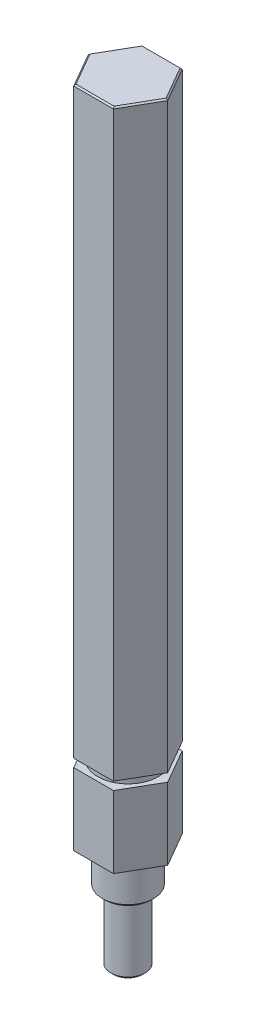
ISO-10303-21;
HEADER;
FILE_DESCRIPTION(('STEP AP214'),'2;1');
FILE_NAME('part.step','',(''),(''),'','','');
FILE_SCHEMA(('AUTOMOTIVE_DESIGN { 1 0 10303 214 1 1 1 1 }'));
ENDSEC;
DATA;
#1=APPLICATION_CONTEXT('core data for automotive mechanical design processes');
#2=APPLICATION_PROTOCOL_DEFINITION('international standard','automotive_design',2000,#1);
#3=PRODUCT_CONTEXT('',#1,'mechanical');
#4=PRODUCT('Part','Part','',(#3));
#5=PRODUCT_RELATED_PRODUCT_CATEGORY('part','',(#4));
#6=PRODUCT_DEFINITION_FORMATION('','',#4);
#7=PRODUCT_DEFINITION_CONTEXT('part definition',#1,'design');
#8=PRODUCT_DEFINITION('design','',#6,#7);
#9=PRODUCT_DEFINITION_SHAPE('','',#8);
#10=(LENGTH_UNIT() NAMED_UNIT(*) SI_UNIT(.MILLI.,.METRE.));
#11=(NAMED_UNIT(*) PLANE_ANGLE_UNIT() SI_UNIT($,.RADIAN.));
#12=(NAMED_UNIT(*) SI_UNIT($,.STERADIAN.) SOLID_ANGLE_UNIT());
#13=UNCERTAINTY_MEASURE_WITH_UNIT(LENGTH_MEASURE(1.E-05),#10,'distance_accuracy_value','');
#14=(GEOMETRIC_REPRESENTATION_CONTEXT(3) GLOBAL_UNCERTAINTY_ASSIGNED_CONTEXT((#13)) GLOBAL_UNIT_ASSIGNED_CONTEXT((#10,
#11,#12)) REPRESENTATION_CONTEXT('',''));
#15=CARTESIAN_POINT('',(0.,0.,0.));
#16=DIRECTION('',(0.,0.,1.));
#17=DIRECTION('',(1.,0.,0.));
#18=AXIS2_PLACEMENT_3D('',#15,#16,#17);
#19=CARTESIAN_POINT('',(-45.6394821348514,-25.4,-16.669011646302));
#20=DIRECTION('',(-0.866025403784438,0.,0.5));
#21=DIRECTION('',(0.5,0.,0.866025403784439));
#22=AXIS2_PLACEMENT_3D('',#19,#20,#21);
#23=PLANE('',#22);
#24=DIRECTION('',(0.5,0.,0.866025403784439));
#25=VECTOR('',#24,1.);
#26=CARTESIAN_POINT('',(-45.6394821348514,-12.1158,-16.669011646302));
#27=LINE('',#26,#25);
#28=CARTESIAN_POINT('',(-45.6394821348514,-12.1158,-16.669011646302));
#29=VERTEX_POINT('',#28);
#30=CARTESIAN_POINT('',(-41.9733079254973,-12.1158,-10.319011646302));
#31=VERTEX_POINT('',#30);
#32=EDGE_CURVE('E262',#29,#31,#27,.T.);
#33=ORIENTED_EDGE('',*,*,#32,.F.);
#34=DIRECTION('',(0.,1.,0.));
#35=VECTOR('',#34,1.);
#36=CARTESIAN_POINT('',(-45.6394821348514,-25.4,-16.669011646302));
#37=LINE('',#36,#35);
#38=CARTESIAN_POINT('',(-45.6394821348514,-25.4,-16.669011646302));
#39=VERTEX_POINT('',#38);
#40=EDGE_CURVE('E298',#39,#29,#37,.T.);
#41=ORIENTED_EDGE('',*,*,#40,.F.);
#42=DIRECTION('',(0.5,0.,0.866025403784439));
#43=VECTOR('',#42,1.);
#44=CARTESIAN_POINT('',(-45.6394821348514,-25.4,-16.669011646302));
#45=LINE('',#44,#43);
#46=CARTESIAN_POINT('',(-41.9733079254973,-25.4,-10.319011646302));
#47=VERTEX_POINT('',#46);
#48=EDGE_CURVE('E282',#39,#47,#45,.T.);
#49=ORIENTED_EDGE('',*,*,#48,.T.);
#50=DIRECTION('',(0.,1.,0.));
#51=VECTOR('',#50,1.);
#52=CARTESIAN_POINT('',(-41.9733079254973,-25.4,-10.319011646302));
#53=LINE('',#52,#51);
#54=EDGE_CURVE('E191',#47,#31,#53,.T.);
#55=ORIENTED_EDGE('',*,*,#54,.T.);
#56=EDGE_LOOP('',(#33,#41,#49,#55));
#57=FACE_BOUND('',#56,.T.);
#58=ADVANCED_FACE('F48',(#57),#23,.T.);
#59=CARTESIAN_POINT('',(-41.9733079254973,-25.4,-10.319011646302));
#60=DIRECTION('',(0.,0.,1.));
#61=DIRECTION('',(1.,0.,0.));
#62=AXIS2_PLACEMENT_3D('',#59,#60,#61);
#63=PLANE('',#62);
#64=DIRECTION('',(1.,0.,0.));
#65=VECTOR('',#64,1.);
#66=CARTESIAN_POINT('',(-41.9733079254973,-12.1158,-10.319011646302));
#67=LINE('',#66,#65);
#68=CARTESIAN_POINT('',(-34.640959506789,-12.1158,-10.319011646302));
#69=VERTEX_POINT('',#68);
#70=EDGE_CURVE('E163',#31,#69,#67,.T.);
#71=ORIENTED_EDGE('',*,*,#70,.F.);
#72=ORIENTED_EDGE('',*,*,#54,.F.);
#73=DIRECTION('',(1.,0.,0.));
#74=VECTOR('',#73,1.);
#75=CARTESIAN_POINT('',(-41.9733079254973,-25.4,-10.319011646302));
#76=LINE('',#75,#74);
#77=CARTESIAN_POINT('',(-34.640959506789,-25.4,-10.319011646302));
#78=VERTEX_POINT('',#77);
#79=EDGE_CURVE('E283',#47,#78,#76,.T.);
#80=ORIENTED_EDGE('',*,*,#79,.T.);
#81=DIRECTION('',(0.,1.,0.));
#82=VECTOR('',#81,1.);
#83=CARTESIAN_POINT('',(-34.640959506789,-25.4,-10.319011646302));
#84=LINE('',#83,#82);
#85=EDGE_CURVE('E185',#78,#69,#84,.T.);
#86=ORIENTED_EDGE('',*,*,#85,.T.);
#87=EDGE_LOOP('',(#71,#72,#80,#86));
#88=FACE_BOUND('',#87,.T.);
#89=ADVANCED_FACE('F356',(#88),#63,.T.);
#90=CARTESIAN_POINT('',(-34.640959506789,-25.4,-10.319011646302));
#91=DIRECTION('',(0.866025403784438,0.,0.500000000000001));
#92=DIRECTION('',(0.500000000000001,0.,-0.866025403784438));
#93=AXIS2_PLACEMENT_3D('',#90,#91,#92);
#94=PLANE('',#93);
#95=DIRECTION('',(0.500000000000001,0.,-0.866025403784438));
#96=VECTOR('',#95,1.);
#97=CARTESIAN_POINT('',(-34.640959506789,-12.1158,-10.319011646302));
#98=LINE('',#97,#96);
#99=CARTESIAN_POINT('',(-30.9747852974349,-12.1158,-16.669011646302));
#100=VERTEX_POINT('',#99);
#101=EDGE_CURVE('E157',#69,#100,#98,.T.);
#102=ORIENTED_EDGE('',*,*,#101,.F.);
#103=ORIENTED_EDGE('',*,*,#85,.F.);
#104=DIRECTION('',(0.500000000000001,0.,-0.866025403784438));
#105=VECTOR('',#104,1.);
#106=CARTESIAN_POINT('',(-34.640959506789,-25.4,-10.319011646302));
#107=LINE('',#106,#105);
#108=CARTESIAN_POINT('',(-30.9747852974349,-25.4,-16.669011646302));
#109=VERTEX_POINT('',#108);
#110=EDGE_CURVE('E179',#78,#109,#107,.T.);
#111=ORIENTED_EDGE('',*,*,#110,.T.);
#112=DIRECTION('',(0.,1.,0.));
#113=VECTOR('',#112,1.);
#114=CARTESIAN_POINT('',(-30.9747852974349,-25.4,-16.669011646302));
#115=LINE('',#114,#113);
#116=EDGE_CURVE('E172',#109,#100,#115,.T.);
#117=ORIENTED_EDGE('',*,*,#116,.T.);
#118=EDGE_LOOP('',(#102,#103,#111,#117));
#119=FACE_BOUND('',#118,.T.);
#120=ADVANCED_FACE('F177',(#119),#94,.T.);
#121=CARTESIAN_POINT('',(-30.9747852974349,-25.4,-16.669011646302));
#122=DIRECTION('',(0.866025403784438,0.,-0.5));
#123=DIRECTION('',(-0.5,0.,-0.866025403784439));
#124=AXIS2_PLACEMENT_3D('',#121,#122,#123);
#125=PLANE('',#124);
#126=DIRECTION('',(-0.5,0.,-0.866025403784439));
#127=VECTOR('',#126,1.);
#128=CARTESIAN_POINT('',(-30.9747852974349,-12.1158,-16.669011646302));
#129=LINE('',#128,#127);
#130=CARTESIAN_POINT('',(-34.640959506789,-12.1158,-23.019011646302));
#131=VERTEX_POINT('',#130);
#132=EDGE_CURVE('E160',#100,#131,#129,.T.);
#133=ORIENTED_EDGE('',*,*,#132,.F.);
#134=ORIENTED_EDGE('',*,*,#116,.F.);
#135=DIRECTION('',(-0.5,0.,-0.866025403784439));
#136=VECTOR('',#135,1.);
#137=CARTESIAN_POINT('',(-30.9747852974349,-25.4,-16.669011646302));
#138=LINE('',#137,#136);
#139=CARTESIAN_POINT('',(-34.640959506789,-25.4,-23.019011646302));
#140=VERTEX_POINT('',#139);
#141=EDGE_CURVE('E287',#109,#140,#138,.T.);
#142=ORIENTED_EDGE('',*,*,#141,.T.);
#143=DIRECTION('',(0.,1.,0.));
#144=VECTOR('',#143,1.);
#145=CARTESIAN_POINT('',(-34.640959506789,-25.4,-23.019011646302));
#146=LINE('',#145,#144);
#147=EDGE_CURVE('E174',#140,#131,#146,.T.);
#148=ORIENTED_EDGE('',*,*,#147,.T.);
#149=EDGE_LOOP('',(#133,#134,#142,#148));
#150=FACE_BOUND('',#149,.T.);
#151=ADVANCED_FACE('F170',(#150),#125,.T.);
#152=CARTESIAN_POINT('',(-34.640959506789,-25.4,-23.019011646302));
#153=DIRECTION('',(0.,0.,-1.));
#154=DIRECTION('',(-1.,0.,0.));
#155=AXIS2_PLACEMENT_3D('',#152,#153,#154);
#156=PLANE('',#155);
#157=DIRECTION('',(-1.,0.,0.));
#158=VECTOR('',#157,1.);
#159=CARTESIAN_POINT('',(-34.640959506789,-12.1158,-23.019011646302));
#160=LINE('',#159,#158);
#161=CARTESIAN_POINT('',(-41.9733079254973,-12.1158,-23.019011646302));
#162=VERTEX_POINT('',#161);
#163=EDGE_CURVE('E175',#131,#162,#160,.T.);
#164=ORIENTED_EDGE('',*,*,#163,.F.);
#165=ORIENTED_EDGE('',*,*,#147,.F.);
#166=DIRECTION('',(-1.,0.,0.));
#167=VECTOR('',#166,1.);
#168=CARTESIAN_POINT('',(-34.640959506789,-25.4,-23.019011646302));
#169=LINE('',#168,#167);
#170=CARTESIAN_POINT('',(-41.9733079254973,-25.4,-23.019011646302));
#171=VERTEX_POINT('',#170);
#172=EDGE_CURVE('E289',#140,#171,#169,.T.);
#173=ORIENTED_EDGE('',*,*,#172,.T.);
#174=DIRECTION('',(0.,1.,0.));
#175=VECTOR('',#174,1.);
#176=CARTESIAN_POINT('',(-41.9733079254973,-25.4,-23.019011646302));
#177=LINE('',#176,#175);
#178=EDGE_CURVE('E301',#171,#162,#177,.T.);
#179=ORIENTED_EDGE('',*,*,#178,.T.);
#180=EDGE_LOOP('',(#164,#165,#173,#179));
#181=FACE_BOUND('',#180,.T.);
#182=ADVANCED_FACE('F461',(#181),#156,.T.);
#183=CARTESIAN_POINT('',(-41.9733079254973,-25.4,-23.019011646302));
#184=DIRECTION('',(-0.866025403784438,0.,-0.5));
#185=DIRECTION('',(-0.5,0.,0.866025403784439));
#186=AXIS2_PLACEMENT_3D('',#183,#184,#185);
#187=PLANE('',#186);
#188=DIRECTION('',(-0.5,0.,0.866025403784439));
#189=VECTOR('',#188,1.);
#190=CARTESIAN_POINT('',(-41.9733079254973,-12.1158,-23.019011646302));
#191=LINE('',#190,#189);
#192=EDGE_CURVE('E206',#162,#29,#191,.T.);
#193=ORIENTED_EDGE('',*,*,#192,.F.);
#194=ORIENTED_EDGE('',*,*,#178,.F.);
#195=DIRECTION('',(-0.5,0.,0.866025403784439));
#196=VECTOR('',#195,1.);
#197=CARTESIAN_POINT('',(-41.9733079254973,-25.4,-23.019011646302));
#198=LINE('',#197,#196);
#199=EDGE_CURVE('E292',#171,#39,#198,.T.);
#200=ORIENTED_EDGE('',*,*,#199,.T.);
#201=ORIENTED_EDGE('',*,*,#40,.T.);
#202=EDGE_LOOP('',(#193,#194,#200,#201));
#203=FACE_BOUND('',#202,.T.);
#204=ADVANCED_FACE('F471',(#203),#187,.T.);
#205=CARTESIAN_POINT('',(-38.3071337161431,-25.4,-3.96901164630201));
#206=DIRECTION('',(0.,1.,0.));
#207=DIRECTION('',(0.,0.,1.));
#208=AXIS2_PLACEMENT_3D('',#205,#206,#207);
#209=PLANE('',#208);
#210=CARTESIAN_POINT('',(-38.3071337161431,-25.4,-16.669011646302));
#211=DIRECTION('',(0.,1.,0.));
#212=DIRECTION('',(1.,0.,0.));
#213=AXIS2_PLACEMENT_3D('',#210,#211,#212);
#214=CIRCLE('',#213,4.7498);
#215=CARTESIAN_POINT('',(-33.5573337161431,-25.4,-16.669011646302));
#216=VERTEX_POINT('',#215);
#217=EDGE_CURVE('E278',#216,#216,#214,.T.);
#218=ORIENTED_EDGE('',*,*,#217,.T.);
#219=EDGE_LOOP('',(#218));
#220=FACE_BOUND('',#219,.T.);
#221=ORIENTED_EDGE('',*,*,#48,.F.);
#222=ORIENTED_EDGE('',*,*,#199,.F.);
#223=ORIENTED_EDGE('',*,*,#172,.F.);
#224=ORIENTED_EDGE('',*,*,#141,.F.);
#225=ORIENTED_EDGE('',*,*,#110,.F.);
#226=ORIENTED_EDGE('',*,*,#79,.F.);
#227=EDGE_LOOP('',(#221,#222,#223,#224,#225,#226));
#228=FACE_BOUND('',#227,.T.);
#229=ADVANCED_FACE('F577',(#220,#228),#209,.F.);
#230=CARTESIAN_POINT('',(-38.3071337161431,-32.512,-16.669011646302));
#231=DIRECTION('',(0.,1.,0.));
#232=DIRECTION('',(0.,0.,1.));
#233=AXIS2_PLACEMENT_3D('',#230,#231,#232);
#234=CYLINDRICAL_SURFACE('',#233,4.7498);
#235=CARTESIAN_POINT('',(-38.3071337161431,-32.004,-16.669011646302));
#236=DIRECTION('',(0.,1.,0.));
#237=DIRECTION('',(0.,0.,1.));
#238=AXIS2_PLACEMENT_3D('',#235,#236,#237);
#239=CIRCLE('',#238,4.7498);
#240=CARTESIAN_POINT('',(-38.3071337161431,-32.004,-11.919211646302));
#241=VERTEX_POINT('',#240);
#242=EDGE_CURVE('E194',#241,#241,#239,.T.);
#243=ORIENTED_EDGE('',*,*,#242,.T.);
#244=EDGE_LOOP('',(#243));
#245=FACE_BOUND('',#244,.T.);
#246=ORIENTED_EDGE('',*,*,#217,.F.);
#247=EDGE_LOOP('',(#246));
#248=FACE_BOUND('',#247,.T.);
#249=ADVANCED_FACE('F566',(#245,#248),#234,.T.);
#250=CARTESIAN_POINT('',(-38.3071337161431,-32.512,-16.669011646302));
#251=DIRECTION('',(0.,1.,0.));
#252=DIRECTION('',(0.,0.,1.));
#253=AXIS2_PLACEMENT_3D('',#250,#251,#252);
#254=PLANE('',#253);
#255=CARTESIAN_POINT('',(-38.3071337161431,-32.512,-16.669011646302));
#256=DIRECTION('',(0.,1.,0.));
#257=DIRECTION('',(0.,0.,1.));
#258=AXIS2_PLACEMENT_3D('',#255,#256,#257);
#259=CIRCLE('',#258,3.1623);
#260=CARTESIAN_POINT('',(-38.3071337161431,-32.512,-13.506711646302));
#261=VERTEX_POINT('',#260);
#262=EDGE_CURVE('E274',#261,#261,#259,.T.);
#263=ORIENTED_EDGE('',*,*,#262,.T.);
#264=EDGE_LOOP('',(#263));
#265=FACE_BOUND('',#264,.T.);
#266=CARTESIAN_POINT('',(-38.3071337161431,-32.512,-16.669011646302));
#267=DIRECTION('',(0.,1.,0.));
#268=DIRECTION('',(0.,0.,1.));
#269=AXIS2_PLACEMENT_3D('',#266,#267,#268);
#270=CIRCLE('',#269,4.2418);
#271=CARTESIAN_POINT('',(-38.3071337161431,-32.512,-12.427211646302));
#272=VERTEX_POINT('',#271);
#273=EDGE_CURVE('E197',#272,#272,#270,.F.);
#274=ORIENTED_EDGE('',*,*,#273,.T.);
#275=EDGE_LOOP('',(#274));
#276=FACE_BOUND('',#275,.T.);
#277=ADVANCED_FACE('F554',(#265,#276),#254,.F.);
#278=CARTESIAN_POINT('',(-38.3071337161431,-32.004,-16.669011646302));
#279=DIRECTION('',(0.,1.,0.));
#280=DIRECTION('',(0.,0.,1.));
#281=AXIS2_PLACEMENT_3D('',#278,#279,#280);
#282=CONICAL_SURFACE('',#281,4.7498,0.785398163397443);
#283=ORIENTED_EDGE('',*,*,#273,.F.);
#284=EDGE_LOOP('',(#283));
#285=FACE_BOUND('',#284,.T.);
#286=ORIENTED_EDGE('',*,*,#242,.F.);
#287=EDGE_LOOP('',(#286));
#288=FACE_BOUND('',#287,.T.);
#289=ADVANCED_FACE('F541',(#285,#288),#282,.T.);
#290=CARTESIAN_POINT('',(-38.3071337161431,-45.212,-16.669011646302));
#291=DIRECTION('',(0.,1.,0.));
#292=DIRECTION('',(0.,0.,1.));
#293=AXIS2_PLACEMENT_3D('',#290,#291,#292);
#294=CYLINDRICAL_SURFACE('',#293,3.1623);
#295=CARTESIAN_POINT('',(-38.3071337161431,-44.704,-16.669011646302));
#296=DIRECTION('',(0.,1.,0.));
#297=DIRECTION('',(0.,0.,1.));
#298=AXIS2_PLACEMENT_3D('',#295,#296,#297);
#299=CIRCLE('',#298,3.1623);
#300=CARTESIAN_POINT('',(-38.3071337161431,-44.704,-13.506711646302));
#301=VERTEX_POINT('',#300);
#302=EDGE_CURVE('E200',#301,#301,#299,.T.);
#303=ORIENTED_EDGE('',*,*,#302,.T.);
#304=EDGE_LOOP('',(#303));
#305=FACE_BOUND('',#304,.T.);
#306=ORIENTED_EDGE('',*,*,#262,.F.);
#307=EDGE_LOOP('',(#306));
#308=FACE_BOUND('',#307,.T.);
#309=ADVANCED_FACE('F529',(#305,#308),#294,.T.);
#310=CARTESIAN_POINT('',(-38.3071337161431,-45.212,-16.669011646302));
#311=DIRECTION('',(0.,1.,0.));
#312=DIRECTION('',(0.,0.,1.));
#313=AXIS2_PLACEMENT_3D('',#310,#311,#312);
#314=PLANE('',#313);
#315=CARTESIAN_POINT('',(-38.3071337161431,-45.212,-16.669011646302));
#316=DIRECTION('',(0.,1.,0.));
#317=DIRECTION('',(0.,0.,1.));
#318=AXIS2_PLACEMENT_3D('',#315,#316,#317);
#319=CIRCLE('',#318,2.6543);
#320=CARTESIAN_POINT('',(-38.3071337161431,-45.212,-14.014711646302));
#321=VERTEX_POINT('',#320);
#322=EDGE_CURVE('E203',#321,#321,#319,.F.);
#323=ORIENTED_EDGE('',*,*,#322,.T.);
#324=EDGE_LOOP('',(#323));
#325=FACE_BOUND('',#324,.T.);
#326=ADVANCED_FACE('F483',(#325),#314,.F.);
#327=CARTESIAN_POINT('',(-38.3071337161431,-44.704,-16.669011646302));
#328=DIRECTION('',(0.,1.,0.));
#329=DIRECTION('',(0.,0.,1.));
#330=AXIS2_PLACEMENT_3D('',#327,#328,#329);
#331=CONICAL_SURFACE('',#330,3.1623,0.785398163397445);
#332=ORIENTED_EDGE('',*,*,#322,.F.);
#333=EDGE_LOOP('',(#332));
#334=FACE_BOUND('',#333,.T.);
#335=ORIENTED_EDGE('',*,*,#302,.F.);
#336=EDGE_LOOP('',(#335));
#337=FACE_BOUND('',#336,.T.);
#338=ADVANCED_FACE('F477',(#334,#337),#331,.T.);
#339=CARTESIAN_POINT('',(-38.3071337161431,-25.4,-16.669011646302));
#340=DIRECTION('',(0.,1.,0.));
#341=DIRECTION('',(0.,0.,1.));
#342=AXIS2_PLACEMENT_3D('',#339,#340,#341);
#343=CYLINDRICAL_SURFACE('',#342,5.58800000000003);
#344=CARTESIAN_POINT('',(-38.3071337161431,-10.6172,-16.669011646302));
#345=DIRECTION('',(0.,1.,0.));
#346=DIRECTION('',(0.,0.,1.));
#347=AXIS2_PLACEMENT_3D('',#344,#345,#346);
#348=CIRCLE('',#347,5.58800000000003);
#349=CARTESIAN_POINT('',(-38.3071337161431,-10.6172,-11.081011646302));
#350=VERTEX_POINT('',#349);
#351=EDGE_CURVE('E253',#350,#350,#348,.T.);
#352=ORIENTED_EDGE('',*,*,#351,.F.);
#353=EDGE_LOOP('',(#352));
#354=FACE_BOUND('',#353,.T.);
#355=CARTESIAN_POINT('',(-38.3071337161431,-12.1158,-16.669011646302));
#356=DIRECTION('',(0.,1.,0.));
#357=DIRECTION('',(0.,0.,1.));
#358=AXIS2_PLACEMENT_3D('',#355,#356,#357);
#359=CIRCLE('',#358,5.58800000000003);
#360=CARTESIAN_POINT('',(-38.3071337161431,-12.1158,-11.081011646302));
#361=VERTEX_POINT('',#360);
#362=EDGE_CURVE('E247',#361,#361,#359,.T.);
#363=ORIENTED_EDGE('',*,*,#362,.T.);
#364=EDGE_LOOP('',(#363));
#365=FACE_BOUND('',#364,.T.);
#366=ADVANCED_FACE('F482',(#354,#365),#343,.T.);
#367=CARTESIAN_POINT('',(-32.7191337161431,-10.6172,-16.669011646302));
#368=DIRECTION('',(0.,1.,0.));
#369=DIRECTION('',(0.,0.,1.));
#370=AXIS2_PLACEMENT_3D('',#367,#368,#369);
#371=PLANE('',#370);
#372=DIRECTION('',(0.5,0.,0.866025403784439));
#373=VECTOR('',#372,1.);
#374=CARTESIAN_POINT('',(-30.9747852974349,-10.6172,-16.669011646302));
#375=LINE('',#374,#373);
#376=CARTESIAN_POINT('',(-34.640959506789,-10.6172,-23.019011646302));
#377=VERTEX_POINT('',#376);
#378=CARTESIAN_POINT('',(-30.9747852974349,-10.6172,-16.669011646302));
#379=VERTEX_POINT('',#378);
#380=EDGE_CURVE('E266',#377,#379,#375,.T.);
#381=ORIENTED_EDGE('',*,*,#380,.T.);
#382=DIRECTION('',(-0.500000000000001,0.,0.866025403784438));
#383=VECTOR('',#382,1.);
#384=CARTESIAN_POINT('',(-34.640959506789,-10.6172,-10.319011646302));
#385=LINE('',#384,#383);
#386=CARTESIAN_POINT('',(-34.640959506789,-10.6172,-10.319011646302));
#387=VERTEX_POINT('',#386);
#388=EDGE_CURVE('E268',#379,#387,#385,.T.);
#389=ORIENTED_EDGE('',*,*,#388,.T.);
#390=DIRECTION('',(-1.,0.,0.));
#391=VECTOR('',#390,1.);
#392=CARTESIAN_POINT('',(-41.9733079254973,-10.6172,-10.319011646302));
#393=LINE('',#392,#391);
#394=CARTESIAN_POINT('',(-41.9733079254973,-10.6172,-10.319011646302));
#395=VERTEX_POINT('',#394);
#396=EDGE_CURVE('E270',#387,#395,#393,.T.);
#397=ORIENTED_EDGE('',*,*,#396,.T.);
#398=DIRECTION('',(-0.5,0.,-0.866025403784439));
#399=VECTOR('',#398,1.);
#400=CARTESIAN_POINT('',(-45.6394821348514,-10.6172,-16.669011646302));
#401=LINE('',#400,#399);
#402=CARTESIAN_POINT('',(-45.6394821348514,-10.6172,-16.669011646302));
#403=VERTEX_POINT('',#402);
#404=EDGE_CURVE('E272',#395,#403,#401,.T.);
#405=ORIENTED_EDGE('',*,*,#404,.T.);
#406=DIRECTION('',(0.5,0.,-0.866025403784439));
#407=VECTOR('',#406,1.);
#408=CARTESIAN_POINT('',(-41.9733079254973,-10.6172,-23.019011646302));
#409=LINE('',#408,#407);
#410=CARTESIAN_POINT('',(-41.9733079254973,-10.6172,-23.019011646302));
#411=VERTEX_POINT('',#410);
#412=EDGE_CURVE('E208',#403,#411,#409,.T.);
#413=ORIENTED_EDGE('',*,*,#412,.T.);
#414=DIRECTION('',(1.,0.,0.));
#415=VECTOR('',#414,1.);
#416=CARTESIAN_POINT('',(-34.640959506789,-10.6172,-23.019011646302));
#417=LINE('',#416,#415);
#418=EDGE_CURVE('E264',#411,#377,#417,.T.);
#419=ORIENTED_EDGE('',*,*,#418,.T.);
#420=EDGE_LOOP('',(#381,#389,#397,#405,#413,#419));
#421=FACE_BOUND('',#420,.T.);
#422=ORIENTED_EDGE('',*,*,#351,.T.);
#423=EDGE_LOOP('',(#422));
#424=FACE_BOUND('',#423,.T.);
#425=ADVANCED_FACE('F497',(#421,#424),#371,.F.);
#426=CARTESIAN_POINT('',(-21.7881364409388,-12.1158,-16.669011646302));
#427=DIRECTION('',(0.,-1.,0.));
#428=DIRECTION('',(0.,0.,-1.));
#429=AXIS2_PLACEMENT_3D('',#426,#427,#428);
#430=PLANE('',#429);
#431=ORIENTED_EDGE('',*,*,#362,.F.);
#432=EDGE_LOOP('',(#431));
#433=FACE_BOUND('',#432,.T.);
#434=ORIENTED_EDGE('',*,*,#32,.T.);
#435=ORIENTED_EDGE('',*,*,#70,.T.);
#436=ORIENTED_EDGE('',*,*,#101,.T.);
#437=ORIENTED_EDGE('',*,*,#132,.T.);
#438=ORIENTED_EDGE('',*,*,#163,.T.);
#439=ORIENTED_EDGE('',*,*,#192,.T.);
#440=EDGE_LOOP('',(#434,#435,#436,#437,#438,#439));
#441=FACE_BOUND('',#440,.T.);
#442=ADVANCED_FACE('F159',(#433,#441),#430,.F.);
#443=CARTESIAN_POINT('',(-45.6394821348514,96.8273400000005,-16.669011646302));
#444=VERTEX_POINT('',#443);
#445=EDGE_CURVE('E295',#403,#444,#37,.T.);
#446=ORIENTED_EDGE('',*,*,#445,.T.);
#447=DIRECTION('',(0.5,0.,-0.866025403784439));
#448=VECTOR('',#447,1.);
#449=CARTESIAN_POINT('',(-41.9733079254972,96.8273400000005,-23.0190116463021));
#450=LINE('',#449,#448);
#451=CARTESIAN_POINT('',(-41.9733079254973,96.8273400000005,-23.019011646302));
#452=VERTEX_POINT('',#451);
#453=EDGE_CURVE('E228',#444,#452,#450,.T.);
#454=ORIENTED_EDGE('',*,*,#453,.T.);
#455=EDGE_CURVE('E300',#411,#452,#177,.T.);
#456=ORIENTED_EDGE('',*,*,#455,.F.);
#457=ORIENTED_EDGE('',*,*,#412,.F.);
#458=EDGE_LOOP('',(#446,#454,#456,#457));
#459=FACE_BOUND('',#458,.T.);
#460=ADVANCED_FACE('F343',(#459),#187,.T.);
#461=ORIENTED_EDGE('',*,*,#455,.T.);
#462=DIRECTION('',(1.,0.,0.));
#463=VECTOR('',#462,1.);
#464=CARTESIAN_POINT('',(-34.6409595067889,96.8273400000005,-23.019011646302));
#465=LINE('',#464,#463);
#466=CARTESIAN_POINT('',(-34.640959506789,96.8273400000005,-23.019011646302));
#467=VERTEX_POINT('',#466);
#468=EDGE_CURVE('E72',#452,#467,#465,.T.);
#469=ORIENTED_EDGE('',*,*,#468,.T.);
#470=EDGE_CURVE('E303',#377,#467,#146,.T.);
#471=ORIENTED_EDGE('',*,*,#470,.F.);
#472=ORIENTED_EDGE('',*,*,#418,.F.);
#473=EDGE_LOOP('',(#461,#469,#471,#472));
#474=FACE_BOUND('',#473,.T.);
#475=ADVANCED_FACE('F307',(#474),#156,.T.);
#476=ORIENTED_EDGE('',*,*,#470,.T.);
#477=DIRECTION('',(0.5,0.,0.866025403784439));
#478=VECTOR('',#477,1.);
#479=CARTESIAN_POINT('',(-30.9747852974349,96.8273400000005,-16.669011646302));
#480=LINE('',#479,#478);
#481=CARTESIAN_POINT('',(-30.9747852974349,96.8273400000005,-16.669011646302));
#482=VERTEX_POINT('',#481);
#483=EDGE_CURVE('E57',#467,#482,#480,.T.);
#484=ORIENTED_EDGE('',*,*,#483,.T.);
#485=EDGE_CURVE('E182',#379,#482,#115,.T.);
#486=ORIENTED_EDGE('',*,*,#485,.F.);
#487=ORIENTED_EDGE('',*,*,#380,.F.);
#488=EDGE_LOOP('',(#476,#484,#486,#487));
#489=FACE_BOUND('',#488,.T.);
#490=ADVANCED_FACE('F442',(#489),#125,.T.);
#491=ORIENTED_EDGE('',*,*,#485,.T.);
#492=DIRECTION('',(-0.500000000000001,0.,0.866025403784438));
#493=VECTOR('',#492,1.);
#494=CARTESIAN_POINT('',(-34.640959506789,96.8273400000005,-10.3190116463021));
#495=LINE('',#494,#493);
#496=CARTESIAN_POINT('',(-34.640959506789,96.8273400000005,-10.319011646302));
#497=VERTEX_POINT('',#496);
#498=EDGE_CURVE('E11',#482,#497,#495,.T.);
#499=ORIENTED_EDGE('',*,*,#498,.T.);
#500=EDGE_CURVE('E181',#387,#497,#84,.T.);
#501=ORIENTED_EDGE('',*,*,#500,.F.);
#502=ORIENTED_EDGE('',*,*,#388,.F.);
#503=EDGE_LOOP('',(#491,#499,#501,#502));
#504=FACE_BOUND('',#503,.T.);
#505=ADVANCED_FACE('F321',(#504),#94,.T.);
#506=ORIENTED_EDGE('',*,*,#500,.T.);
#507=DIRECTION('',(-1.,0.,0.));
#508=VECTOR('',#507,1.);
#509=CARTESIAN_POINT('',(-41.9733079254972,96.8273400000005,-10.319011646302));
#510=LINE('',#509,#508);
#511=CARTESIAN_POINT('',(-41.9733079254973,96.8273400000005,-10.319011646302));
#512=VERTEX_POINT('',#511);
#513=EDGE_CURVE('E223',#497,#512,#510,.T.);
#514=ORIENTED_EDGE('',*,*,#513,.T.);
#515=EDGE_CURVE('E190',#395,#512,#53,.T.);
#516=ORIENTED_EDGE('',*,*,#515,.F.);
#517=ORIENTED_EDGE('',*,*,#396,.F.);
#518=EDGE_LOOP('',(#506,#514,#516,#517));
#519=FACE_BOUND('',#518,.T.);
#520=ADVANCED_FACE('F326',(#519),#63,.T.);
#521=ORIENTED_EDGE('',*,*,#515,.T.);
#522=DIRECTION('',(-0.5,0.,-0.866025403784439));
#523=VECTOR('',#522,1.);
#524=CARTESIAN_POINT('',(-45.6394821348514,96.8273400000005,-16.669011646302));
#525=LINE('',#524,#523);
#526=EDGE_CURVE('E226',#512,#444,#525,.T.);
#527=ORIENTED_EDGE('',*,*,#526,.T.);
#528=ORIENTED_EDGE('',*,*,#445,.F.);
#529=ORIENTED_EDGE('',*,*,#404,.F.);
#530=EDGE_LOOP('',(#521,#527,#528,#529));
#531=FACE_BOUND('',#530,.T.);
#532=ADVANCED_FACE('F341',(#531),#23,.T.);
#533=CARTESIAN_POINT('',(-38.3071337161451,97.0813400000005,-16.6690116463026));
#534=DIRECTION('',(0.,1.,0.));
#535=DIRECTION('',(-0.500000000000001,0.,0.866025403784438));
#536=AXIS2_PLACEMENT_3D('',#533,#534,#535);
#537=PLANE('',#536);
#538=DIRECTION('',(0.5,0.,0.866025403784439));
#539=VECTOR('',#538,1.);
#540=CARTESIAN_POINT('',(-43.5864245776138,97.0813400000005,-13.6210116463033));
#541=LINE('',#540,#539);
#542=CARTESIAN_POINT('',(-45.3461881981031,97.0813400000005,-16.669011646302));
#543=VERTEX_POINT('',#542);
#544=CARTESIAN_POINT('',(-41.8266609571231,97.0813400000005,-10.573011646302));
#545=VERTEX_POINT('',#544);
#546=EDGE_CURVE('E218',#543,#545,#541,.T.);
#547=ORIENTED_EDGE('',*,*,#546,.T.);
#548=DIRECTION('',(1.,0.,0.));
#549=VECTOR('',#548,1.);
#550=CARTESIAN_POINT('',(-38.3071337161451,97.0813400000005,-10.573011646302));
#551=LINE('',#550,#549);
#552=CARTESIAN_POINT('',(-34.7876064751632,97.0813400000005,-10.573011646302));
#553=VERTEX_POINT('',#552);
#554=EDGE_CURVE('E220',#545,#553,#551,.T.);
#555=ORIENTED_EDGE('',*,*,#554,.T.);
#556=DIRECTION('',(0.500000000000001,0.,-0.866025403784438));
#557=VECTOR('',#556,1.);
#558=CARTESIAN_POINT('',(-33.0278428546734,97.0813400000005,-13.6210116463016));
#559=LINE('',#558,#557);
#560=CARTESIAN_POINT('',(-31.2680792341832,97.0813400000005,-16.669011646302));
#561=VERTEX_POINT('',#560);
#562=EDGE_CURVE('E210',#553,#561,#559,.T.);
#563=ORIENTED_EDGE('',*,*,#562,.T.);
#564=DIRECTION('',(-0.5,0.,-0.866025403784439));
#565=VECTOR('',#564,1.);
#566=CARTESIAN_POINT('',(-33.0278428546739,97.0813400000005,-19.7170116463033));
#567=LINE('',#566,#565);
#568=CARTESIAN_POINT('',(-34.7876064751632,97.0813400000005,-22.765011646302));
#569=VERTEX_POINT('',#568);
#570=EDGE_CURVE('E212',#561,#569,#567,.T.);
#571=ORIENTED_EDGE('',*,*,#570,.T.);
#572=DIRECTION('',(-1.,0.,0.));
#573=VECTOR('',#572,1.);
#574=CARTESIAN_POINT('',(-38.3071337161451,97.0813400000005,-22.765011646302));
#575=LINE('',#574,#573);
#576=CARTESIAN_POINT('',(-41.8266609571231,97.0813400000005,-22.765011646302));
#577=VERTEX_POINT('',#576);
#578=EDGE_CURVE('E214',#569,#577,#575,.T.);
#579=ORIENTED_EDGE('',*,*,#578,.T.);
#580=DIRECTION('',(-0.5,0.,0.866025403784439));
#581=VECTOR('',#580,1.);
#582=CARTESIAN_POINT('',(-43.5864245776133,97.0813400000005,-19.7170116463016));
#583=LINE('',#582,#581);
#584=EDGE_CURVE('E216',#577,#543,#583,.T.);
#585=ORIENTED_EDGE('',*,*,#584,.T.);
#586=EDGE_LOOP('',(#547,#555,#563,#571,#579,#585));
#587=FACE_BOUND('',#586,.T.);
#588=ADVANCED_FACE('F346',(#587),#537,.T.);
#589=CARTESIAN_POINT('',(-38.3071337161451,97.0813400000005,-22.765011646302));
#590=DIRECTION('',(0.,-0.707106781186551,0.707106781186544));
#591=DIRECTION('',(0.,-0.707106781186544,-0.707106781186551));
#592=AXIS2_PLACEMENT_3D('',#589,#590,#591);
#593=PLANE('',#592);
#594=DIRECTION('',(-0.377964473009204,0.654653670707981,0.654653670707987));
#595=VECTOR('',#594,1.);
#596=CARTESIAN_POINT('',(-35.2903960810172,97.9521971428573,-21.8941545034452));
#597=LINE('',#596,#595);
#598=EDGE_CURVE('E241',#467,#569,#597,.T.);
#599=ORIENTED_EDGE('',*,*,#598,.F.);
#600=ORIENTED_EDGE('',*,*,#468,.F.);
#601=DIRECTION('',(0.377964473009226,0.654653670707974,0.654653670707981));
#602=VECTOR('',#601,1.);
#603=CARTESIAN_POINT('',(-41.3238713512691,97.9521971428571,-21.8941545034453));
#604=LINE('',#603,#602);
#605=EDGE_CURVE('E52',#577,#452,#604,.F.);
#606=ORIENTED_EDGE('',*,*,#605,.F.);
#607=ORIENTED_EDGE('',*,*,#578,.F.);
#608=EDGE_LOOP('',(#599,#600,#606,#607));
#609=FACE_BOUND('',#608,.T.);
#610=ADVANCED_FACE('F50',(#609),#593,.F.);
#611=CARTESIAN_POINT('',(-43.5864245776133,97.0813400000005,-19.7170116463016));
#612=DIRECTION('',(0.612372435695792,-0.70710678118655,0.353553390593274));
#613=DIRECTION('',(0.755928946018457,0.654653670707975,0.));
#614=AXIS2_PLACEMENT_3D('',#611,#612,#613);
#615=PLANE('',#614);
#616=ORIENTED_EDGE('',*,*,#605,.T.);
#617=ORIENTED_EDGE('',*,*,#453,.F.);
#618=DIRECTION('',(0.75592894601846,0.654653670707971,0.));
#619=VECTOR('',#618,1.);
#620=CARTESIAN_POINT('',(-44.3406089863946,97.9521971428575,-16.669011646302));
#621=LINE('',#620,#619);
#622=EDGE_CURVE('E239',#543,#444,#621,.F.);
#623=ORIENTED_EDGE('',*,*,#622,.F.);
#624=ORIENTED_EDGE('',*,*,#584,.F.);
#625=EDGE_LOOP('',(#616,#617,#623,#624));
#626=FACE_BOUND('',#625,.T.);
#627=ADVANCED_FACE('F344',(#626),#615,.F.);
#628=CARTESIAN_POINT('',(-33.0278428546739,97.0813400000005,-19.7170116463033));
#629=DIRECTION('',(-0.612372435695803,-0.707106781186538,0.353553390593279));
#630=DIRECTION('',(0.755928946018445,-0.654653670707988,0.));
#631=AXIS2_PLACEMENT_3D('',#628,#629,#630);
#632=PLANE('',#631);
#633=ORIENTED_EDGE('',*,*,#598,.T.);
#634=ORIENTED_EDGE('',*,*,#570,.F.);
#635=DIRECTION('',(-0.755928946018449,0.654653670707983,0.));
#636=VECTOR('',#635,1.);
#637=CARTESIAN_POINT('',(-32.2736584458919,97.9521971428577,-16.669011646302));
#638=LINE('',#637,#636);
#639=EDGE_CURVE('E236',#482,#561,#638,.T.);
#640=ORIENTED_EDGE('',*,*,#639,.F.);
#641=ORIENTED_EDGE('',*,*,#483,.F.);
#642=EDGE_LOOP('',(#633,#634,#640,#641));
#643=FACE_BOUND('',#642,.T.);
#644=ADVANCED_FACE('F313',(#643),#632,.F.);
#645=CARTESIAN_POINT('',(-43.5864245776138,97.0813400000005,-13.6210116463033));
#646=DIRECTION('',(0.612372435695786,-0.707106781186557,-0.353553390593269));
#647=DIRECTION('',(0.755928946018464,0.654653670707967,0.));
#648=AXIS2_PLACEMENT_3D('',#645,#646,#647);
#649=PLANE('',#648);
#650=ORIENTED_EDGE('',*,*,#622,.T.);
#651=ORIENTED_EDGE('',*,*,#526,.F.);
#652=DIRECTION('',(0.37796447300925,0.654653670707974,-0.654653670707967));
#653=VECTOR('',#652,1.);
#654=CARTESIAN_POINT('',(-41.3238713512686,97.9521971428579,-11.4438687891594));
#655=LINE('',#654,#653);
#656=EDGE_CURVE('E234',#545,#512,#655,.F.);
#657=ORIENTED_EDGE('',*,*,#656,.F.);
#658=ORIENTED_EDGE('',*,*,#546,.F.);
#659=EDGE_LOOP('',(#650,#651,#657,#658));
#660=FACE_BOUND('',#659,.T.);
#661=ADVANCED_FACE('F336',(#660),#649,.F.);
#662=CARTESIAN_POINT('',(-33.0278428546734,97.0813400000005,-13.6210116463016));
#663=DIRECTION('',(-0.612372435695796,-0.707106781186546,-0.353553390593275));
#664=DIRECTION('',(0.755928946018453,-0.654653670707979,0.));
#665=AXIS2_PLACEMENT_3D('',#662,#663,#664);
#666=PLANE('',#665);
#667=ORIENTED_EDGE('',*,*,#639,.T.);
#668=ORIENTED_EDGE('',*,*,#562,.F.);
#669=DIRECTION('',(0.377964473009228,-0.65465367070798,0.654653670707973));
#670=VECTOR('',#669,1.);
#671=CARTESIAN_POINT('',(-35.2903960810174,97.9521971428575,-11.443868789159));
#672=LINE('',#671,#670);
#673=EDGE_CURVE('E232',#497,#553,#672,.F.);
#674=ORIENTED_EDGE('',*,*,#673,.F.);
#675=ORIENTED_EDGE('',*,*,#498,.F.);
#676=EDGE_LOOP('',(#667,#668,#674,#675));
#677=FACE_BOUND('',#676,.T.);
#678=ADVANCED_FACE('F318',(#677),#666,.F.);
#679=CARTESIAN_POINT('',(-38.3071337161451,97.0813400000005,-10.573011646302));
#680=DIRECTION('',(0.,-0.707106781186544,-0.707106781186551));
#681=DIRECTION('',(0.,0.707106781186551,-0.707106781186544));
#682=AXIS2_PLACEMENT_3D('',#679,#680,#681);
#683=PLANE('',#682);
#684=ORIENTED_EDGE('',*,*,#656,.T.);
#685=ORIENTED_EDGE('',*,*,#513,.F.);
#686=ORIENTED_EDGE('',*,*,#673,.T.);
#687=ORIENTED_EDGE('',*,*,#554,.F.);
#688=EDGE_LOOP('',(#684,#685,#686,#687));
#689=FACE_BOUND('',#688,.T.);
#690=ADVANCED_FACE('F330',(#689),#683,.F.);
#691=CLOSED_SHELL('',(#58,#89,#120,#151,#182,#204,#229,#249,#277,#289,#309,#326,#338,#366,#425,
#442,#460,#475,#490,#505,#520,#532,#588,#610,#627,#644,#661,#678,#690));
#692=MANIFOLD_SOLID_BREP('B2',#691);
#693=ADVANCED_BREP_SHAPE_REPRESENTATION('',(#18,#692),#14);
#694=SHAPE_DEFINITION_REPRESENTATION(#9,#693);
ENDSEC;
END-ISO-10303-21;
